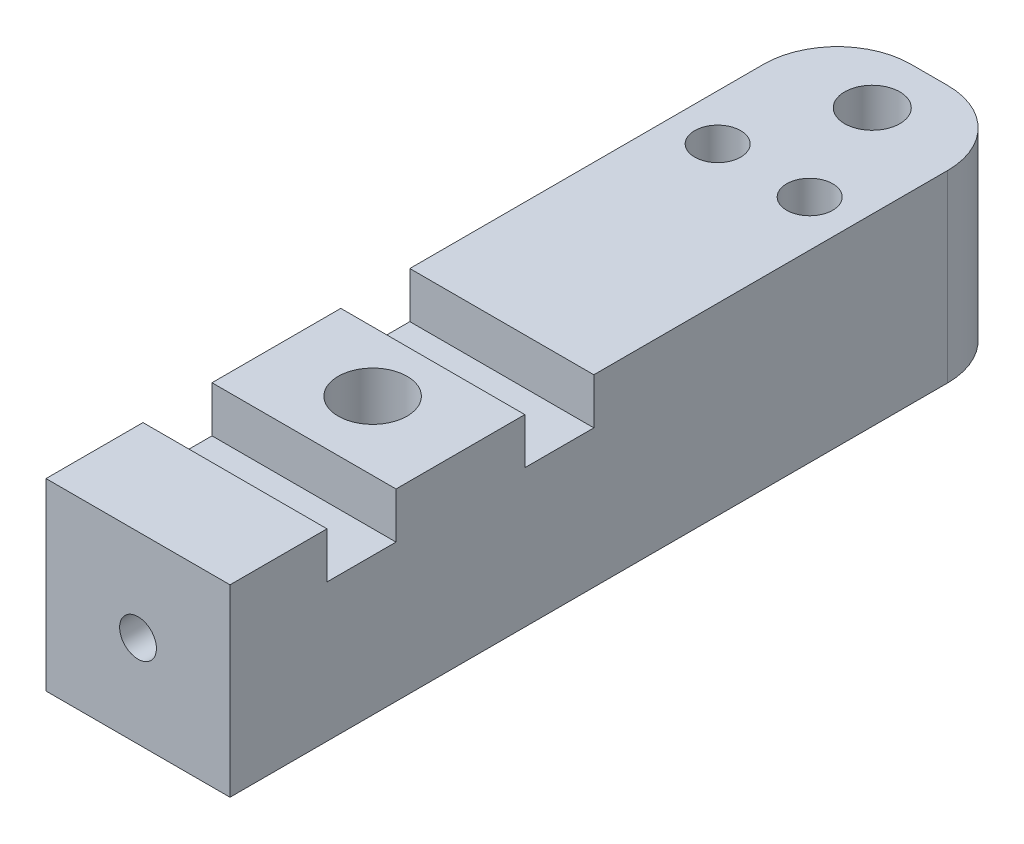
ISO-10303-21;
HEADER;
FILE_DESCRIPTION(('STEP AP214'),'2;1');
FILE_NAME('part.step','',(''),(''),'','','');
FILE_SCHEMA(('AUTOMOTIVE_DESIGN { 1 0 10303 214 1 1 1 1 }'));
ENDSEC;
DATA;
#1=APPLICATION_CONTEXT('core data for automotive mechanical design processes');
#2=APPLICATION_PROTOCOL_DEFINITION('international standard','automotive_design',2000,#1);
#3=PRODUCT_CONTEXT('',#1,'mechanical');
#4=PRODUCT('Part','Part','',(#3));
#5=PRODUCT_RELATED_PRODUCT_CATEGORY('part','',(#4));
#6=PRODUCT_DEFINITION_FORMATION('','',#4);
#7=PRODUCT_DEFINITION_CONTEXT('part definition',#1,'design');
#8=PRODUCT_DEFINITION('design','',#6,#7);
#9=PRODUCT_DEFINITION_SHAPE('','',#8);
#10=(LENGTH_UNIT() NAMED_UNIT(*) SI_UNIT(.MILLI.,.METRE.));
#11=(NAMED_UNIT(*) PLANE_ANGLE_UNIT() SI_UNIT($,.RADIAN.));
#12=(NAMED_UNIT(*) SI_UNIT($,.STERADIAN.) SOLID_ANGLE_UNIT());
#13=UNCERTAINTY_MEASURE_WITH_UNIT(LENGTH_MEASURE(1.E-05),#10,'distance_accuracy_value','');
#14=(GEOMETRIC_REPRESENTATION_CONTEXT(3) GLOBAL_UNCERTAINTY_ASSIGNED_CONTEXT((#13)) GLOBAL_UNIT_ASSIGNED_CONTEXT((#10,
#11,#12)) REPRESENTATION_CONTEXT('',''));
#15=CARTESIAN_POINT('',(0.,0.,0.));
#16=DIRECTION('',(0.,0.,1.));
#17=DIRECTION('',(1.,0.,0.));
#18=AXIS2_PLACEMENT_3D('',#15,#16,#17);
#19=CARTESIAN_POINT('',(4.,10.,-39.));
#20=DIRECTION('',(0.,-1.,0.));
#21=DIRECTION('',(0.,0.,-1.));
#22=AXIS2_PLACEMENT_3D('',#19,#20,#21);
#23=PLANE('',#22);
#24=CARTESIAN_POINT('',(5.,10.,-39.9));
#25=DIRECTION('',(0.,1.,0.));
#26=DIRECTION('',(0.,0.,1.));
#27=AXIS2_PLACEMENT_3D('',#24,#25,#26);
#28=CIRCLE('',#27,1.5);
#29=CARTESIAN_POINT('',(5.,10.,-38.4));
#30=VERTEX_POINT('',#29);
#31=EDGE_CURVE('E349',#30,#30,#28,.T.);
#32=ORIENTED_EDGE('',*,*,#31,.F.);
#33=EDGE_LOOP('',(#32));
#34=FACE_BOUND('',#33,.T.);
#35=CARTESIAN_POINT('',(2.5,10.,-34.));
#36=DIRECTION('',(0.,1.,0.));
#37=DIRECTION('',(0.,0.,1.));
#38=AXIS2_PLACEMENT_3D('',#35,#36,#37);
#39=CIRCLE('',#38,1.25);
#40=CARTESIAN_POINT('',(2.5,10.,-32.75));
#41=VERTEX_POINT('',#40);
#42=EDGE_CURVE('E205',#41,#41,#39,.T.);
#43=ORIENTED_EDGE('',*,*,#42,.F.);
#44=EDGE_LOOP('',(#43));
#45=FACE_BOUND('',#44,.T.);
#46=CARTESIAN_POINT('',(7.5,10.,-34.));
#47=DIRECTION('',(0.,1.,0.));
#48=DIRECTION('',(0.,0.,-1.));
#49=AXIS2_PLACEMENT_3D('',#46,#47,#48);
#50=CIRCLE('',#49,1.25);
#51=CARTESIAN_POINT('',(7.5,10.,-35.25));
#52=VERTEX_POINT('',#51);
#53=EDGE_CURVE('E199',#52,#52,#50,.T.);
#54=ORIENTED_EDGE('',*,*,#53,.F.);
#55=EDGE_LOOP('',(#54));
#56=FACE_BOUND('',#55,.T.);
#57=DIRECTION('',(1.,0.,0.));
#58=VECTOR('',#57,1.);
#59=CARTESIAN_POINT('',(0.,10.,-19.7703087555033));
#60=LINE('',#59,#58);
#61=CARTESIAN_POINT('',(0.,10.,-19.7703087555033));
#62=VERTEX_POINT('',#61);
#63=CARTESIAN_POINT('',(10.,10.,-19.7703087555033));
#64=VERTEX_POINT('',#63);
#65=EDGE_CURVE('E140',#62,#64,#60,.T.);
#66=ORIENTED_EDGE('',*,*,#65,.T.);
#67=DIRECTION('',(0.,0.,-1.));
#68=VECTOR('',#67,1.);
#69=CARTESIAN_POINT('',(10.,10.,0.));
#70=LINE('',#69,#68);
#71=CARTESIAN_POINT('',(10.,10.,-39.));
#72=VERTEX_POINT('',#71);
#73=EDGE_CURVE('E217',#64,#72,#70,.T.);
#74=ORIENTED_EDGE('',*,*,#73,.T.);
#75=CARTESIAN_POINT('',(6.,10.,-39.));
#76=DIRECTION('',(0.,1.,0.));
#77=DIRECTION('',(0.,0.,1.));
#78=AXIS2_PLACEMENT_3D('',#75,#76,#77);
#79=CIRCLE('',#78,4.);
#80=CARTESIAN_POINT('',(6.,10.,-43.));
#81=VERTEX_POINT('',#80);
#82=EDGE_CURVE('E221',#72,#81,#79,.T.);
#83=ORIENTED_EDGE('',*,*,#82,.T.);
#84=DIRECTION('',(-1.,0.,0.));
#85=VECTOR('',#84,1.);
#86=CARTESIAN_POINT('',(4.,10.,-43.));
#87=LINE('',#86,#85);
#88=CARTESIAN_POINT('',(4.,10.,-43.));
#89=VERTEX_POINT('',#88);
#90=EDGE_CURVE('E224',#81,#89,#87,.T.);
#91=ORIENTED_EDGE('',*,*,#90,.T.);
#92=CARTESIAN_POINT('',(4.,10.,-39.));
#93=DIRECTION('',(0.,1.,0.));
#94=DIRECTION('',(0.,0.,-1.));
#95=AXIS2_PLACEMENT_3D('',#92,#93,#94);
#96=CIRCLE('',#95,4.);
#97=CARTESIAN_POINT('',(0.,10.,-39.));
#98=VERTEX_POINT('',#97);
#99=EDGE_CURVE('E226',#89,#98,#96,.T.);
#100=ORIENTED_EDGE('',*,*,#99,.T.);
#101=DIRECTION('',(0.,0.,1.));
#102=VECTOR('',#101,1.);
#103=CARTESIAN_POINT('',(0.,10.,0.));
#104=LINE('',#103,#102);
#105=EDGE_CURVE('E211',#98,#62,#104,.T.);
#106=ORIENTED_EDGE('',*,*,#105,.T.);
#107=EDGE_LOOP('',(#66,#74,#83,#91,#100,#106));
#108=FACE_BOUND('',#107,.T.);
#109=ADVANCED_FACE('F33',(#34,#45,#56,#108),#23,.F.);
#110=CARTESIAN_POINT('',(5.,10.,-12.75));
#111=DIRECTION('',(0.,1.,0.));
#112=DIRECTION('',(0.,0.,1.));
#113=AXIS2_PLACEMENT_3D('',#110,#111,#112);
#114=CIRCLE('',#113,1.875);
#115=CARTESIAN_POINT('',(5.,10.,-10.875));
#116=VERTEX_POINT('',#115);
#117=EDGE_CURVE('E193',#116,#116,#114,.T.);
#118=ORIENTED_EDGE('',*,*,#117,.F.);
#119=EDGE_LOOP('',(#118));
#120=FACE_BOUND('',#119,.T.);
#121=CARTESIAN_POINT('',(10.,10.,-9.02030875550334));
#122=VERTEX_POINT('',#121);
#123=CARTESIAN_POINT('',(10.,10.,-16.0203087555033));
#124=VERTEX_POINT('',#123);
#125=EDGE_CURVE('E222',#122,#124,#70,.T.);
#126=ORIENTED_EDGE('',*,*,#125,.T.);
#127=DIRECTION('',(1.,0.,0.));
#128=VECTOR('',#127,1.);
#129=CARTESIAN_POINT('',(0.,10.,-16.0203087555033));
#130=LINE('',#129,#128);
#131=CARTESIAN_POINT('',(0.,10.,-16.0203087555033));
#132=VERTEX_POINT('',#131);
#133=EDGE_CURVE('E153',#132,#124,#130,.T.);
#134=ORIENTED_EDGE('',*,*,#133,.F.);
#135=CARTESIAN_POINT('',(0.,10.,-9.02030875550334));
#136=VERTEX_POINT('',#135);
#137=EDGE_CURVE('E214',#132,#136,#104,.T.);
#138=ORIENTED_EDGE('',*,*,#137,.T.);
#139=DIRECTION('',(1.,0.,0.));
#140=VECTOR('',#139,1.);
#141=CARTESIAN_POINT('',(0.,10.,-9.02030875550334));
#142=LINE('',#141,#140);
#143=EDGE_CURVE('E180',#136,#122,#142,.T.);
#144=ORIENTED_EDGE('',*,*,#143,.T.);
#145=EDGE_LOOP('',(#126,#134,#138,#144));
#146=FACE_BOUND('',#145,.T.);
#147=ADVANCED_FACE('F283',(#120,#146),#23,.F.);
#148=CARTESIAN_POINT('',(0.,10.,0.));
#149=DIRECTION('',(1.,0.,0.));
#150=DIRECTION('',(0.,0.,-1.));
#151=AXIS2_PLACEMENT_3D('',#148,#149,#150);
#152=PLANE('',#151);
#153=DIRECTION('',(0.,1.,0.));
#154=VECTOR('',#153,1.);
#155=CARTESIAN_POINT('',(0.,7.5,-19.7703087555033));
#156=LINE('',#155,#154);
#157=CARTESIAN_POINT('',(0.,7.5,-19.7703087555033));
#158=VERTEX_POINT('',#157);
#159=EDGE_CURVE('E135',#158,#62,#156,.T.);
#160=ORIENTED_EDGE('',*,*,#159,.T.);
#161=ORIENTED_EDGE('',*,*,#105,.F.);
#162=DIRECTION('',(0.,-1.,0.));
#163=VECTOR('',#162,1.);
#164=CARTESIAN_POINT('',(0.,10.,-39.));
#165=LINE('',#164,#163);
#166=CARTESIAN_POINT('',(0.,0.,-39.));
#167=VERTEX_POINT('',#166);
#168=EDGE_CURVE('E228',#98,#167,#165,.T.);
#169=ORIENTED_EDGE('',*,*,#168,.T.);
#170=DIRECTION('',(0.,0.,1.));
#171=VECTOR('',#170,1.);
#172=CARTESIAN_POINT('',(0.,0.,0.));
#173=LINE('',#172,#171);
#174=CARTESIAN_POINT('',(0.,0.,0.));
#175=VERTEX_POINT('',#174);
#176=EDGE_CURVE('E208',#167,#175,#173,.T.);
#177=ORIENTED_EDGE('',*,*,#176,.T.);
#178=DIRECTION('',(0.,-1.,0.));
#179=VECTOR('',#178,1.);
#180=CARTESIAN_POINT('',(0.,10.,0.));
#181=LINE('',#180,#179);
#182=CARTESIAN_POINT('',(0.,10.,0.));
#183=VERTEX_POINT('',#182);
#184=EDGE_CURVE('E11',#183,#175,#181,.T.);
#185=ORIENTED_EDGE('',*,*,#184,.F.);
#186=CARTESIAN_POINT('',(0.,10.,-5.27030875550334));
#187=VERTEX_POINT('',#186);
#188=EDGE_CURVE('E215',#187,#183,#104,.T.);
#189=ORIENTED_EDGE('',*,*,#188,.F.);
#190=DIRECTION('',(0.,1.,0.));
#191=VECTOR('',#190,1.);
#192=CARTESIAN_POINT('',(0.,7.5,-5.27030875550334));
#193=LINE('',#192,#191);
#194=CARTESIAN_POINT('',(0.,7.5,-5.27030875550334));
#195=VERTEX_POINT('',#194);
#196=EDGE_CURVE('E189',#195,#187,#193,.T.);
#197=ORIENTED_EDGE('',*,*,#196,.F.);
#198=DIRECTION('',(0.,0.,1.));
#199=VECTOR('',#198,1.);
#200=CARTESIAN_POINT('',(0.,7.5,0.));
#201=LINE('',#200,#199);
#202=CARTESIAN_POINT('',(0.,7.5,-9.02030875550334));
#203=VERTEX_POINT('',#202);
#204=EDGE_CURVE('E173',#203,#195,#201,.T.);
#205=ORIENTED_EDGE('',*,*,#204,.F.);
#206=DIRECTION('',(0.,1.,0.));
#207=VECTOR('',#206,1.);
#208=CARTESIAN_POINT('',(0.,7.5,-9.02030875550334));
#209=LINE('',#208,#207);
#210=EDGE_CURVE('E179',#203,#136,#209,.T.);
#211=ORIENTED_EDGE('',*,*,#210,.T.);
#212=ORIENTED_EDGE('',*,*,#137,.F.);
#213=DIRECTION('',(0.,1.,0.));
#214=VECTOR('',#213,1.);
#215=CARTESIAN_POINT('',(0.,7.5,-16.0203087555033));
#216=LINE('',#215,#214);
#217=CARTESIAN_POINT('',(0.,7.5,-16.0203087555033));
#218=VERTEX_POINT('',#217);
#219=EDGE_CURVE('E145',#218,#132,#216,.T.);
#220=ORIENTED_EDGE('',*,*,#219,.F.);
#221=DIRECTION('',(0.,0.,1.));
#222=VECTOR('',#221,1.);
#223=CARTESIAN_POINT('',(0.,7.5,0.));
#224=LINE('',#223,#222);
#225=EDGE_CURVE('E149',#158,#218,#224,.T.);
#226=ORIENTED_EDGE('',*,*,#225,.F.);
#227=EDGE_LOOP('',(#160,#161,#169,#177,#185,#189,#197,#205,#211,#212,#220,#226));
#228=FACE_BOUND('',#227,.T.);
#229=ADVANCED_FACE('F35',(#228),#152,.F.);
#230=CARTESIAN_POINT('',(10.,10.,0.));
#231=DIRECTION('',(-1.,0.,0.));
#232=DIRECTION('',(0.,0.,1.));
#233=AXIS2_PLACEMENT_3D('',#230,#231,#232);
#234=PLANE('',#233);
#235=DIRECTION('',(0.,1.,0.));
#236=VECTOR('',#235,1.);
#237=CARTESIAN_POINT('',(10.,7.5,-19.7703087555033));
#238=LINE('',#237,#236);
#239=CARTESIAN_POINT('',(10.,7.5,-19.7703087555033));
#240=VERTEX_POINT('',#239);
#241=EDGE_CURVE('E164',#240,#64,#238,.T.);
#242=ORIENTED_EDGE('',*,*,#241,.F.);
#243=DIRECTION('',(0.,0.,-1.));
#244=VECTOR('',#243,1.);
#245=CARTESIAN_POINT('',(10.,7.5,0.));
#246=LINE('',#245,#244);
#247=CARTESIAN_POINT('',(10.,7.5,-16.0203087555033));
#248=VERTEX_POINT('',#247);
#249=EDGE_CURVE('E146',#248,#240,#246,.T.);
#250=ORIENTED_EDGE('',*,*,#249,.F.);
#251=DIRECTION('',(0.,1.,0.));
#252=VECTOR('',#251,1.);
#253=CARTESIAN_POINT('',(10.,7.5,-16.0203087555033));
#254=LINE('',#253,#252);
#255=EDGE_CURVE('E167',#248,#124,#254,.T.);
#256=ORIENTED_EDGE('',*,*,#255,.T.);
#257=ORIENTED_EDGE('',*,*,#125,.F.);
#258=DIRECTION('',(0.,1.,0.));
#259=VECTOR('',#258,1.);
#260=CARTESIAN_POINT('',(10.,7.5,-9.02030875550334));
#261=LINE('',#260,#259);
#262=CARTESIAN_POINT('',(10.,7.5,-9.02030875550334));
#263=VERTEX_POINT('',#262);
#264=EDGE_CURVE('E162',#263,#122,#261,.T.);
#265=ORIENTED_EDGE('',*,*,#264,.F.);
#266=DIRECTION('',(0.,0.,-1.));
#267=VECTOR('',#266,1.);
#268=CARTESIAN_POINT('',(10.,7.5,0.));
#269=LINE('',#268,#267);
#270=CARTESIAN_POINT('',(10.,7.5,-5.27030875550334));
#271=VERTEX_POINT('',#270);
#272=EDGE_CURVE('E177',#271,#263,#269,.T.);
#273=ORIENTED_EDGE('',*,*,#272,.F.);
#274=DIRECTION('',(0.,1.,0.));
#275=VECTOR('',#274,1.);
#276=CARTESIAN_POINT('',(10.,7.5,-5.27030875550334));
#277=LINE('',#276,#275);
#278=CARTESIAN_POINT('',(10.,10.,-5.27030875550334));
#279=VERTEX_POINT('',#278);
#280=EDGE_CURVE('E186',#271,#279,#277,.T.);
#281=ORIENTED_EDGE('',*,*,#280,.T.);
#282=CARTESIAN_POINT('',(10.,10.,0.));
#283=VERTEX_POINT('',#282);
#284=EDGE_CURVE('E218',#283,#279,#70,.T.);
#285=ORIENTED_EDGE('',*,*,#284,.F.);
#286=DIRECTION('',(0.,-1.,0.));
#287=VECTOR('',#286,1.);
#288=CARTESIAN_POINT('',(10.,10.,0.));
#289=LINE('',#288,#287);
#290=CARTESIAN_POINT('',(10.,0.,0.));
#291=VERTEX_POINT('',#290);
#292=EDGE_CURVE('E41',#283,#291,#289,.T.);
#293=ORIENTED_EDGE('',*,*,#292,.T.);
#294=DIRECTION('',(0.,0.,-1.));
#295=VECTOR('',#294,1.);
#296=CARTESIAN_POINT('',(10.,0.,0.));
#297=LINE('',#296,#295);
#298=CARTESIAN_POINT('',(10.,0.,-39.));
#299=VERTEX_POINT('',#298);
#300=EDGE_CURVE('E233',#291,#299,#297,.T.);
#301=ORIENTED_EDGE('',*,*,#300,.T.);
#302=DIRECTION('',(0.,-1.,0.));
#303=VECTOR('',#302,1.);
#304=CARTESIAN_POINT('',(10.,10.,-39.));
#305=LINE('',#304,#303);
#306=EDGE_CURVE('E249',#72,#299,#305,.T.);
#307=ORIENTED_EDGE('',*,*,#306,.F.);
#308=ORIENTED_EDGE('',*,*,#73,.F.);
#309=EDGE_LOOP('',(#242,#250,#256,#257,#265,#273,#281,#285,#293,#301,#307,#308));
#310=FACE_BOUND('',#309,.T.);
#311=ADVANCED_FACE('F256',(#310),#234,.F.);
#312=ORIENTED_EDGE('',*,*,#284,.T.);
#313=DIRECTION('',(1.,0.,0.));
#314=VECTOR('',#313,1.);
#315=CARTESIAN_POINT('',(0.,10.,-5.27030875550334));
#316=LINE('',#315,#314);
#317=EDGE_CURVE('E174',#187,#279,#316,.T.);
#318=ORIENTED_EDGE('',*,*,#317,.F.);
#319=ORIENTED_EDGE('',*,*,#188,.T.);
#320=DIRECTION('',(1.,0.,0.));
#321=VECTOR('',#320,1.);
#322=CARTESIAN_POINT('',(0.,10.,0.));
#323=LINE('',#322,#321);
#324=EDGE_CURVE('E213',#183,#283,#323,.T.);
#325=ORIENTED_EDGE('',*,*,#324,.T.);
#326=EDGE_LOOP('',(#312,#318,#319,#325));
#327=FACE_BOUND('',#326,.T.);
#328=ADVANCED_FACE('F302',(#327),#23,.F.);
#329=CARTESIAN_POINT('',(4.,0.,-39.));
#330=DIRECTION('',(0.,-1.,0.));
#331=DIRECTION('',(0.,0.,-1.));
#332=AXIS2_PLACEMENT_3D('',#329,#330,#331);
#333=PLANE('',#332);
#334=CARTESIAN_POINT('',(7.5,0.,-34.));
#335=DIRECTION('',(0.,1.,0.));
#336=DIRECTION('',(0.,0.,-1.));
#337=AXIS2_PLACEMENT_3D('',#334,#335,#336);
#338=CIRCLE('',#337,1.25);
#339=CARTESIAN_POINT('',(7.5,0.,-35.25));
#340=VERTEX_POINT('',#339);
#341=EDGE_CURVE('E196',#340,#340,#338,.T.);
#342=ORIENTED_EDGE('',*,*,#341,.T.);
#343=EDGE_LOOP('',(#342));
#344=FACE_BOUND('',#343,.T.);
#345=ORIENTED_EDGE('',*,*,#176,.F.);
#346=CARTESIAN_POINT('',(4.,0.,-39.));
#347=DIRECTION('',(0.,1.,0.));
#348=DIRECTION('',(0.,0.,-1.));
#349=AXIS2_PLACEMENT_3D('',#346,#347,#348);
#350=CIRCLE('',#349,4.);
#351=CARTESIAN_POINT('',(4.,0.,-43.));
#352=VERTEX_POINT('',#351);
#353=EDGE_CURVE('E239',#352,#167,#350,.T.);
#354=ORIENTED_EDGE('',*,*,#353,.F.);
#355=DIRECTION('',(-1.,0.,0.));
#356=VECTOR('',#355,1.);
#357=CARTESIAN_POINT('',(4.,0.,-43.));
#358=LINE('',#357,#356);
#359=CARTESIAN_POINT('',(6.,0.,-43.));
#360=VERTEX_POINT('',#359);
#361=EDGE_CURVE('E237',#360,#352,#358,.T.);
#362=ORIENTED_EDGE('',*,*,#361,.F.);
#363=CARTESIAN_POINT('',(6.,0.,-39.));
#364=DIRECTION('',(0.,1.,0.));
#365=DIRECTION('',(0.,0.,1.));
#366=AXIS2_PLACEMENT_3D('',#363,#364,#365);
#367=CIRCLE('',#366,4.);
#368=EDGE_CURVE('E235',#299,#360,#367,.T.);
#369=ORIENTED_EDGE('',*,*,#368,.F.);
#370=ORIENTED_EDGE('',*,*,#300,.F.);
#371=DIRECTION('',(1.,0.,0.));
#372=VECTOR('',#371,1.);
#373=CARTESIAN_POINT('',(0.,0.,0.));
#374=LINE('',#373,#372);
#375=EDGE_CURVE('E231',#175,#291,#374,.T.);
#376=ORIENTED_EDGE('',*,*,#375,.F.);
#377=EDGE_LOOP('',(#345,#354,#362,#369,#370,#376));
#378=FACE_BOUND('',#377,.T.);
#379=CARTESIAN_POINT('',(2.5,0.,-34.));
#380=DIRECTION('',(0.,1.,0.));
#381=DIRECTION('',(0.,0.,1.));
#382=AXIS2_PLACEMENT_3D('',#379,#380,#381);
#383=CIRCLE('',#382,1.25);
#384=CARTESIAN_POINT('',(2.5,0.,-32.75));
#385=VERTEX_POINT('',#384);
#386=EDGE_CURVE('E202',#385,#385,#383,.T.);
#387=ORIENTED_EDGE('',*,*,#386,.T.);
#388=EDGE_LOOP('',(#387));
#389=FACE_BOUND('',#388,.T.);
#390=CARTESIAN_POINT('',(5.,0.,-12.75));
#391=DIRECTION('',(0.,1.,0.));
#392=DIRECTION('',(0.,0.,1.));
#393=AXIS2_PLACEMENT_3D('',#390,#391,#392);
#394=CIRCLE('',#393,1.875);
#395=CARTESIAN_POINT('',(5.,0.,-10.875));
#396=VERTEX_POINT('',#395);
#397=EDGE_CURVE('E166',#396,#396,#394,.T.);
#398=ORIENTED_EDGE('',*,*,#397,.T.);
#399=EDGE_LOOP('',(#398));
#400=FACE_BOUND('',#399,.T.);
#401=ADVANCED_FACE('F263',(#344,#378,#389,#400),#333,.T.);
#402=CARTESIAN_POINT('',(0.,10.,0.));
#403=DIRECTION('',(0.,0.,-1.));
#404=DIRECTION('',(-1.,0.,0.));
#405=AXIS2_PLACEMENT_3D('',#402,#403,#404);
#406=PLANE('',#405);
#407=CARTESIAN_POINT('',(5.,5.,0.));
#408=DIRECTION('',(0.,0.,1.));
#409=DIRECTION('',(1.,0.,0.));
#410=AXIS2_PLACEMENT_3D('',#407,#408,#409);
#411=CIRCLE('',#410,1.);
#412=CARTESIAN_POINT('',(6.,5.,0.));
#413=VERTEX_POINT('',#412);
#414=EDGE_CURVE('E344',#413,#413,#411,.T.);
#415=ORIENTED_EDGE('',*,*,#414,.F.);
#416=EDGE_LOOP('',(#415));
#417=FACE_BOUND('',#416,.T.);
#418=ORIENTED_EDGE('',*,*,#375,.T.);
#419=ORIENTED_EDGE('',*,*,#292,.F.);
#420=ORIENTED_EDGE('',*,*,#324,.F.);
#421=ORIENTED_EDGE('',*,*,#184,.T.);
#422=EDGE_LOOP('',(#418,#419,#420,#421));
#423=FACE_BOUND('',#422,.T.);
#424=ADVANCED_FACE('F317',(#417,#423),#406,.F.);
#425=CARTESIAN_POINT('',(6.,10.,-39.));
#426=DIRECTION('',(0.,-1.,0.));
#427=DIRECTION('',(0.,0.,-1.));
#428=AXIS2_PLACEMENT_3D('',#425,#426,#427);
#429=CYLINDRICAL_SURFACE('',#428,4.);
#430=ORIENTED_EDGE('',*,*,#368,.T.);
#431=DIRECTION('',(0.,-1.,0.));
#432=VECTOR('',#431,1.);
#433=CARTESIAN_POINT('',(6.,10.,-43.));
#434=LINE('',#433,#432);
#435=EDGE_CURVE('E246',#81,#360,#434,.T.);
#436=ORIENTED_EDGE('',*,*,#435,.F.);
#437=ORIENTED_EDGE('',*,*,#82,.F.);
#438=ORIENTED_EDGE('',*,*,#306,.T.);
#439=EDGE_LOOP('',(#430,#436,#437,#438));
#440=FACE_BOUND('',#439,.T.);
#441=ADVANCED_FACE('F269',(#440),#429,.T.);
#442=CARTESIAN_POINT('',(4.,10.,-43.));
#443=DIRECTION('',(0.,0.,1.));
#444=DIRECTION('',(1.,0.,0.));
#445=AXIS2_PLACEMENT_3D('',#442,#443,#444);
#446=PLANE('',#445);
#447=ORIENTED_EDGE('',*,*,#361,.T.);
#448=DIRECTION('',(0.,-1.,0.));
#449=VECTOR('',#448,1.);
#450=CARTESIAN_POINT('',(4.,10.,-43.));
#451=LINE('',#450,#449);
#452=EDGE_CURVE('E243',#89,#352,#451,.T.);
#453=ORIENTED_EDGE('',*,*,#452,.F.);
#454=ORIENTED_EDGE('',*,*,#90,.F.);
#455=ORIENTED_EDGE('',*,*,#435,.T.);
#456=EDGE_LOOP('',(#447,#453,#454,#455));
#457=FACE_BOUND('',#456,.T.);
#458=ADVANCED_FACE('F273',(#457),#446,.F.);
#459=CARTESIAN_POINT('',(4.,10.,-39.));
#460=DIRECTION('',(0.,-1.,0.));
#461=DIRECTION('',(0.,0.,-1.));
#462=AXIS2_PLACEMENT_3D('',#459,#460,#461);
#463=CYLINDRICAL_SURFACE('',#462,4.);
#464=ORIENTED_EDGE('',*,*,#353,.T.);
#465=ORIENTED_EDGE('',*,*,#168,.F.);
#466=ORIENTED_EDGE('',*,*,#99,.F.);
#467=ORIENTED_EDGE('',*,*,#452,.T.);
#468=EDGE_LOOP('',(#464,#465,#466,#467));
#469=FACE_BOUND('',#468,.T.);
#470=ADVANCED_FACE('F325',(#469),#463,.T.);
#471=CARTESIAN_POINT('',(2.5,10.,-34.));
#472=DIRECTION('',(0.,-1.,0.));
#473=DIRECTION('',(0.,0.,-1.));
#474=AXIS2_PLACEMENT_3D('',#471,#472,#473);
#475=CYLINDRICAL_SURFACE('',#474,1.25);
#476=ORIENTED_EDGE('',*,*,#42,.T.);
#477=EDGE_LOOP('',(#476));
#478=FACE_BOUND('',#477,.T.);
#479=ORIENTED_EDGE('',*,*,#386,.F.);
#480=EDGE_LOOP('',(#479));
#481=FACE_BOUND('',#480,.T.);
#482=ADVANCED_FACE('F327',(#478,#481),#475,.F.);
#483=CARTESIAN_POINT('',(7.5,10.,-34.));
#484=DIRECTION('',(0.,-1.,0.));
#485=DIRECTION('',(0.,0.,-1.));
#486=AXIS2_PLACEMENT_3D('',#483,#484,#485);
#487=CYLINDRICAL_SURFACE('',#486,1.25);
#488=ORIENTED_EDGE('',*,*,#53,.T.);
#489=EDGE_LOOP('',(#488));
#490=FACE_BOUND('',#489,.T.);
#491=ORIENTED_EDGE('',*,*,#341,.F.);
#492=EDGE_LOOP('',(#491));
#493=FACE_BOUND('',#492,.T.);
#494=ADVANCED_FACE('F333',(#490,#493),#487,.F.);
#495=CARTESIAN_POINT('',(5.,10.,-12.75));
#496=DIRECTION('',(0.,-1.,0.));
#497=DIRECTION('',(0.,0.,-1.));
#498=AXIS2_PLACEMENT_3D('',#495,#496,#497);
#499=CYLINDRICAL_SURFACE('',#498,1.875);
#500=ORIENTED_EDGE('',*,*,#117,.T.);
#501=EDGE_LOOP('',(#500));
#502=FACE_BOUND('',#501,.T.);
#503=ORIENTED_EDGE('',*,*,#397,.F.);
#504=EDGE_LOOP('',(#503));
#505=FACE_BOUND('',#504,.T.);
#506=ADVANCED_FACE('F424',(#502,#505),#499,.F.);
#507=CARTESIAN_POINT('',(0.,7.5,-9.02030875550334));
#508=DIRECTION('',(0.,0.,1.));
#509=DIRECTION('',(1.,0.,0.));
#510=AXIS2_PLACEMENT_3D('',#507,#508,#509);
#511=PLANE('',#510);
#512=ORIENTED_EDGE('',*,*,#143,.F.);
#513=ORIENTED_EDGE('',*,*,#210,.F.);
#514=DIRECTION('',(1.,0.,0.));
#515=VECTOR('',#514,1.);
#516=CARTESIAN_POINT('',(0.,7.5,-9.02030875550334));
#517=LINE('',#516,#515);
#518=EDGE_CURVE('E171',#203,#263,#517,.T.);
#519=ORIENTED_EDGE('',*,*,#518,.T.);
#520=ORIENTED_EDGE('',*,*,#264,.T.);
#521=EDGE_LOOP('',(#512,#513,#519,#520));
#522=FACE_BOUND('',#521,.T.);
#523=ADVANCED_FACE('F433',(#522),#511,.T.);
#524=CARTESIAN_POINT('',(0.,7.5,-5.27030875550334));
#525=DIRECTION('',(0.,0.,1.));
#526=DIRECTION('',(1.,0.,0.));
#527=AXIS2_PLACEMENT_3D('',#524,#525,#526);
#528=PLANE('',#527);
#529=ORIENTED_EDGE('',*,*,#317,.T.);
#530=ORIENTED_EDGE('',*,*,#280,.F.);
#531=DIRECTION('',(1.,0.,0.));
#532=VECTOR('',#531,1.);
#533=CARTESIAN_POINT('',(0.,7.5,-5.27030875550334));
#534=LINE('',#533,#532);
#535=EDGE_CURVE('E56',#195,#271,#534,.T.);
#536=ORIENTED_EDGE('',*,*,#535,.F.);
#537=ORIENTED_EDGE('',*,*,#196,.T.);
#538=EDGE_LOOP('',(#529,#530,#536,#537));
#539=FACE_BOUND('',#538,.T.);
#540=ADVANCED_FACE('F463',(#539),#528,.F.);
#541=CARTESIAN_POINT('',(0.,7.5,0.));
#542=DIRECTION('',(0.,1.,0.));
#543=DIRECTION('',(0.,0.,1.));
#544=AXIS2_PLACEMENT_3D('',#541,#542,#543);
#545=PLANE('',#544);
#546=ORIENTED_EDGE('',*,*,#518,.F.);
#547=ORIENTED_EDGE('',*,*,#204,.T.);
#548=ORIENTED_EDGE('',*,*,#535,.T.);
#549=ORIENTED_EDGE('',*,*,#272,.T.);
#550=EDGE_LOOP('',(#546,#547,#548,#549));
#551=FACE_BOUND('',#550,.T.);
#552=ADVANCED_FACE('F297',(#551),#545,.T.);
#553=CARTESIAN_POINT('',(0.,7.5,-19.7703087555033));
#554=DIRECTION('',(0.,0.,1.));
#555=DIRECTION('',(1.,0.,0.));
#556=AXIS2_PLACEMENT_3D('',#553,#554,#555);
#557=PLANE('',#556);
#558=ORIENTED_EDGE('',*,*,#65,.F.);
#559=ORIENTED_EDGE('',*,*,#159,.F.);
#560=DIRECTION('',(1.,0.,0.));
#561=VECTOR('',#560,1.);
#562=CARTESIAN_POINT('',(0.,7.5,-19.7703087555033));
#563=LINE('',#562,#561);
#564=EDGE_CURVE('E138',#158,#240,#563,.T.);
#565=ORIENTED_EDGE('',*,*,#564,.T.);
#566=ORIENTED_EDGE('',*,*,#241,.T.);
#567=EDGE_LOOP('',(#558,#559,#565,#566));
#568=FACE_BOUND('',#567,.T.);
#569=ADVANCED_FACE('F137',(#568),#557,.T.);
#570=CARTESIAN_POINT('',(0.,7.5,-16.0203087555033));
#571=DIRECTION('',(0.,0.,1.));
#572=DIRECTION('',(1.,0.,0.));
#573=AXIS2_PLACEMENT_3D('',#570,#571,#572);
#574=PLANE('',#573);
#575=ORIENTED_EDGE('',*,*,#133,.T.);
#576=ORIENTED_EDGE('',*,*,#255,.F.);
#577=DIRECTION('',(1.,0.,0.));
#578=VECTOR('',#577,1.);
#579=CARTESIAN_POINT('',(0.,7.5,-16.0203087555033));
#580=LINE('',#579,#578);
#581=EDGE_CURVE('E48',#218,#248,#580,.T.);
#582=ORIENTED_EDGE('',*,*,#581,.F.);
#583=ORIENTED_EDGE('',*,*,#219,.T.);
#584=EDGE_LOOP('',(#575,#576,#582,#583));
#585=FACE_BOUND('',#584,.T.);
#586=ADVANCED_FACE('F288',(#585),#574,.F.);
#587=CARTESIAN_POINT('',(0.,7.5,0.));
#588=DIRECTION('',(0.,1.,0.));
#589=DIRECTION('',(0.,0.,1.));
#590=AXIS2_PLACEMENT_3D('',#587,#588,#589);
#591=PLANE('',#590);
#592=ORIENTED_EDGE('',*,*,#564,.F.);
#593=ORIENTED_EDGE('',*,*,#225,.T.);
#594=ORIENTED_EDGE('',*,*,#581,.T.);
#595=ORIENTED_EDGE('',*,*,#249,.T.);
#596=EDGE_LOOP('',(#592,#593,#594,#595));
#597=FACE_BOUND('',#596,.T.);
#598=ADVANCED_FACE('F148',(#597),#591,.T.);
#599=CARTESIAN_POINT('',(5.,3.5,-39.9));
#600=DIRECTION('',(0.,1.,0.));
#601=DIRECTION('',(0.,0.,1.));
#602=AXIS2_PLACEMENT_3D('',#599,#600,#601);
#603=CYLINDRICAL_SURFACE('',#602,1.5);
#604=CARTESIAN_POINT('',(5.,3.5,-39.9));
#605=DIRECTION('',(0.,1.,0.));
#606=DIRECTION('',(0.,0.,1.));
#607=AXIS2_PLACEMENT_3D('',#604,#605,#606);
#608=CIRCLE('',#607,1.5);
#609=CARTESIAN_POINT('',(5.,3.5,-38.4));
#610=VERTEX_POINT('',#609);
#611=EDGE_CURVE('E183',#610,#610,#608,.T.);
#612=ORIENTED_EDGE('',*,*,#611,.F.);
#613=EDGE_LOOP('',(#612));
#614=FACE_BOUND('',#613,.T.);
#615=ORIENTED_EDGE('',*,*,#31,.T.);
#616=EDGE_LOOP('',(#615));
#617=FACE_BOUND('',#616,.T.);
#618=ADVANCED_FACE('F295',(#614,#617),#603,.F.);
#619=CARTESIAN_POINT('',(0.,3.5,0.));
#620=DIRECTION('',(0.,1.,0.));
#621=DIRECTION('',(0.,0.,1.));
#622=AXIS2_PLACEMENT_3D('',#619,#620,#621);
#623=PLANE('',#622);
#624=ORIENTED_EDGE('',*,*,#611,.T.);
#625=EDGE_LOOP('',(#624));
#626=FACE_BOUND('',#625,.T.);
#627=ADVANCED_FACE('F356',(#626),#623,.T.);
#628=CARTESIAN_POINT('',(5.,5.,-7.));
#629=DIRECTION('',(0.,0.,1.));
#630=DIRECTION('',(1.,0.,0.));
#631=AXIS2_PLACEMENT_3D('',#628,#629,#630);
#632=CYLINDRICAL_SURFACE('',#631,1.);
#633=CARTESIAN_POINT('',(5.,5.,-7.));
#634=DIRECTION('',(0.,0.,1.));
#635=DIRECTION('',(1.,0.,0.));
#636=AXIS2_PLACEMENT_3D('',#633,#634,#635);
#637=CIRCLE('',#636,1.);
#638=CARTESIAN_POINT('',(6.,5.,-7.));
#639=VERTEX_POINT('',#638);
#640=EDGE_CURVE('E346',#639,#639,#637,.T.);
#641=ORIENTED_EDGE('',*,*,#640,.F.);
#642=EDGE_LOOP('',(#641));
#643=FACE_BOUND('',#642,.T.);
#644=ORIENTED_EDGE('',*,*,#414,.T.);
#645=EDGE_LOOP('',(#644));
#646=FACE_BOUND('',#645,.T.);
#647=ADVANCED_FACE('F362',(#643,#646),#632,.F.);
#648=CARTESIAN_POINT('',(5.,5.,-7.));
#649=DIRECTION('',(0.,0.,1.));
#650=DIRECTION('',(1.,0.,0.));
#651=AXIS2_PLACEMENT_3D('',#648,#649,#650);
#652=PLANE('',#651);
#653=ORIENTED_EDGE('',*,*,#640,.T.);
#654=EDGE_LOOP('',(#653));
#655=FACE_BOUND('',#654,.T.);
#656=ADVANCED_FACE('F369',(#655),#652,.T.);
#657=CLOSED_SHELL('',(#109,#147,#229,#311,#328,#401,#424,#441,#458,#470,#482,#494,#506,#523,
#540,#552,#569,#586,#598,#618,#627,#647,#656));
#658=MANIFOLD_SOLID_BREP('B2',#657);
#659=ADVANCED_BREP_SHAPE_REPRESENTATION('',(#18,#658),#14);
#660=SHAPE_DEFINITION_REPRESENTATION(#9,#659);
ENDSEC;
END-ISO-10303-21;
